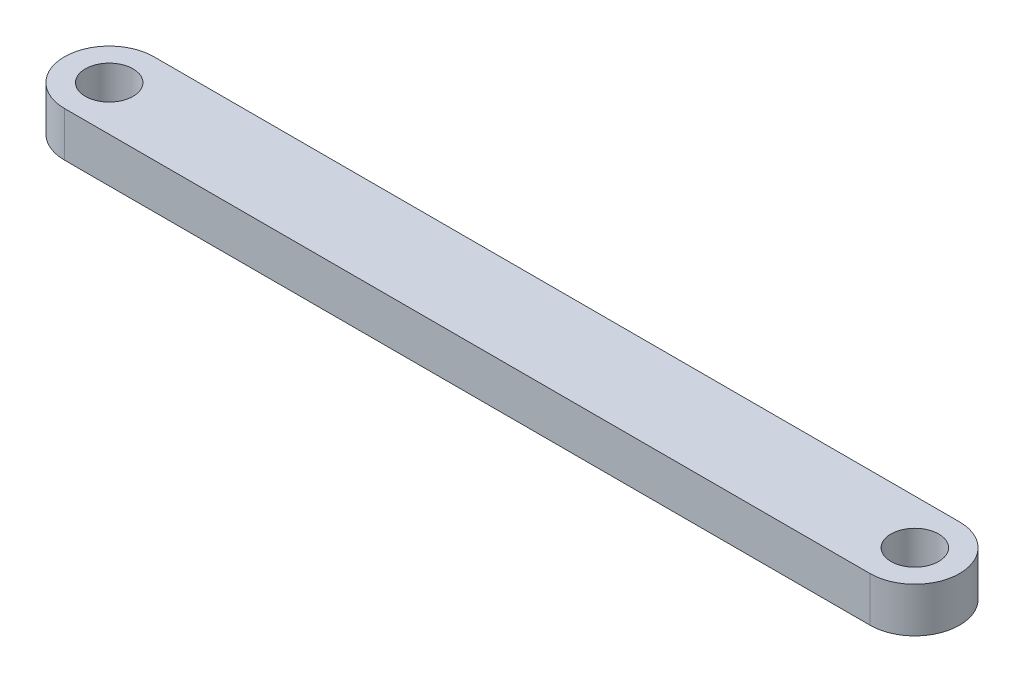
ISO-10303-21;
HEADER;
FILE_DESCRIPTION(('STEP AP214'),'2;1');
FILE_NAME('part.step','',(''),(''),'','','');
FILE_SCHEMA(('AUTOMOTIVE_DESIGN { 1 0 10303 214 1 1 1 1 }'));
ENDSEC;
DATA;
#1=APPLICATION_CONTEXT('core data for automotive mechanical design processes');
#2=APPLICATION_PROTOCOL_DEFINITION('international standard','automotive_design',2000,#1);
#3=PRODUCT_CONTEXT('',#1,'mechanical');
#4=PRODUCT('Part','Part','',(#3));
#5=PRODUCT_RELATED_PRODUCT_CATEGORY('part','',(#4));
#6=PRODUCT_DEFINITION_FORMATION('','',#4);
#7=PRODUCT_DEFINITION_CONTEXT('part definition',#1,'design');
#8=PRODUCT_DEFINITION('design','',#6,#7);
#9=PRODUCT_DEFINITION_SHAPE('','',#8);
#10=(LENGTH_UNIT() NAMED_UNIT(*) SI_UNIT(.MILLI.,.METRE.));
#11=(NAMED_UNIT(*) PLANE_ANGLE_UNIT() SI_UNIT($,.RADIAN.));
#12=(NAMED_UNIT(*) SI_UNIT($,.STERADIAN.) SOLID_ANGLE_UNIT());
#13=UNCERTAINTY_MEASURE_WITH_UNIT(LENGTH_MEASURE(1.E-05),#10,'distance_accuracy_value','');
#14=(GEOMETRIC_REPRESENTATION_CONTEXT(3) GLOBAL_UNCERTAINTY_ASSIGNED_CONTEXT((#13)) GLOBAL_UNIT_ASSIGNED_CONTEXT((#10,
#11,#12)) REPRESENTATION_CONTEXT('',''));
#15=CARTESIAN_POINT('',(0.,0.,0.));
#16=DIRECTION('',(0.,0.,1.));
#17=DIRECTION('',(1.,0.,0.));
#18=AXIS2_PLACEMENT_3D('',#15,#16,#17);
#19=CARTESIAN_POINT('',(-54.,3.,0.));
#20=DIRECTION('',(0.,-1.,0.));
#21=DIRECTION('',(0.,0.,-1.));
#22=AXIS2_PLACEMENT_3D('',#19,#20,#21);
#23=CYLINDRICAL_SURFACE('',#22,3.);
#24=CARTESIAN_POINT('',(-54.,0.,0.));
#25=DIRECTION('',(0.,1.,0.));
#26=DIRECTION('',(0.,0.,1.));
#27=AXIS2_PLACEMENT_3D('',#24,#25,#26);
#28=CIRCLE('',#27,3.);
#29=CARTESIAN_POINT('',(-54.,0.,-3.));
#30=VERTEX_POINT('',#29);
#31=CARTESIAN_POINT('',(-54.,0.,3.));
#32=VERTEX_POINT('',#31);
#33=EDGE_CURVE('E109',#30,#32,#28,.T.);
#34=ORIENTED_EDGE('',*,*,#33,.T.);
#35=DIRECTION('',(0.,-1.,0.));
#36=VECTOR('',#35,1.);
#37=CARTESIAN_POINT('',(-54.,3.,3.));
#38=LINE('',#37,#36);
#39=CARTESIAN_POINT('',(-54.,3.,3.));
#40=VERTEX_POINT('',#39);
#41=EDGE_CURVE('E11',#40,#32,#38,.T.);
#42=ORIENTED_EDGE('',*,*,#41,.F.);
#43=CARTESIAN_POINT('',(-54.,3.,0.));
#44=DIRECTION('',(0.,1.,0.));
#45=DIRECTION('',(0.,0.,1.));
#46=AXIS2_PLACEMENT_3D('',#43,#44,#45);
#47=CIRCLE('',#46,3.);
#48=CARTESIAN_POINT('',(-54.,3.,-3.));
#49=VERTEX_POINT('',#48);
#50=EDGE_CURVE('E93',#49,#40,#47,.T.);
#51=ORIENTED_EDGE('',*,*,#50,.F.);
#52=DIRECTION('',(0.,-1.,0.));
#53=VECTOR('',#52,1.);
#54=CARTESIAN_POINT('',(-54.,3.,-3.));
#55=LINE('',#54,#53);
#56=EDGE_CURVE('E105',#49,#30,#55,.T.);
#57=ORIENTED_EDGE('',*,*,#56,.T.);
#58=EDGE_LOOP('',(#34,#42,#51,#57));
#59=FACE_BOUND('',#58,.T.);
#60=ADVANCED_FACE('F41',(#59),#23,.T.);
#61=CARTESIAN_POINT('',(-54.,3.,3.));
#62=DIRECTION('',(0.,0.,-1.));
#63=DIRECTION('',(-1.,0.,0.));
#64=AXIS2_PLACEMENT_3D('',#61,#62,#63);
#65=PLANE('',#64);
#66=DIRECTION('',(1.,0.,0.));
#67=VECTOR('',#66,1.);
#68=CARTESIAN_POINT('',(-54.,0.,3.));
#69=LINE('',#68,#67);
#70=CARTESIAN_POINT('',(0.,0.,3.));
#71=VERTEX_POINT('',#70);
#72=EDGE_CURVE('E98',#32,#71,#69,.T.);
#73=ORIENTED_EDGE('',*,*,#72,.T.);
#74=DIRECTION('',(0.,-1.,0.));
#75=VECTOR('',#74,1.);
#76=CARTESIAN_POINT('',(0.,3.,3.));
#77=LINE('',#76,#75);
#78=CARTESIAN_POINT('',(0.,3.,3.));
#79=VERTEX_POINT('',#78);
#80=EDGE_CURVE('E50',#79,#71,#77,.T.);
#81=ORIENTED_EDGE('',*,*,#80,.F.);
#82=DIRECTION('',(1.,0.,0.));
#83=VECTOR('',#82,1.);
#84=CARTESIAN_POINT('',(-54.,3.,3.));
#85=LINE('',#84,#83);
#86=EDGE_CURVE('E88',#40,#79,#85,.T.);
#87=ORIENTED_EDGE('',*,*,#86,.F.);
#88=ORIENTED_EDGE('',*,*,#41,.T.);
#89=EDGE_LOOP('',(#73,#81,#87,#88));
#90=FACE_BOUND('',#89,.T.);
#91=ADVANCED_FACE('F97',(#90),#65,.F.);
#92=CARTESIAN_POINT('',(0.,3.,0.));
#93=DIRECTION('',(0.,-1.,0.));
#94=DIRECTION('',(0.,0.,-1.));
#95=AXIS2_PLACEMENT_3D('',#92,#93,#94);
#96=CYLINDRICAL_SURFACE('',#95,3.);
#97=CARTESIAN_POINT('',(0.,0.,0.));
#98=DIRECTION('',(0.,1.,0.));
#99=DIRECTION('',(0.,0.,1.));
#100=AXIS2_PLACEMENT_3D('',#97,#98,#99);
#101=CIRCLE('',#100,3.);
#102=CARTESIAN_POINT('',(0.,0.,-3.));
#103=VERTEX_POINT('',#102);
#104=EDGE_CURVE('E75',#71,#103,#101,.T.);
#105=ORIENTED_EDGE('',*,*,#104,.T.);
#106=DIRECTION('',(0.,-1.,0.));
#107=VECTOR('',#106,1.);
#108=CARTESIAN_POINT('',(0.,3.,-3.));
#109=LINE('',#108,#107);
#110=CARTESIAN_POINT('',(0.,3.,-3.));
#111=VERTEX_POINT('',#110);
#112=EDGE_CURVE('E100',#111,#103,#109,.T.);
#113=ORIENTED_EDGE('',*,*,#112,.F.);
#114=CARTESIAN_POINT('',(0.,3.,0.));
#115=DIRECTION('',(0.,1.,0.));
#116=DIRECTION('',(0.,0.,1.));
#117=AXIS2_PLACEMENT_3D('',#114,#115,#116);
#118=CIRCLE('',#117,3.);
#119=EDGE_CURVE('E91',#79,#111,#118,.T.);
#120=ORIENTED_EDGE('',*,*,#119,.F.);
#121=ORIENTED_EDGE('',*,*,#80,.T.);
#122=EDGE_LOOP('',(#105,#113,#120,#121));
#123=FACE_BOUND('',#122,.T.);
#124=ADVANCED_FACE('F101',(#123),#96,.T.);
#125=CARTESIAN_POINT('',(-54.,3.,-3.));
#126=DIRECTION('',(0.,0.,1.));
#127=DIRECTION('',(1.,0.,0.));
#128=AXIS2_PLACEMENT_3D('',#125,#126,#127);
#129=PLANE('',#128);
#130=DIRECTION('',(-1.,0.,0.));
#131=VECTOR('',#130,1.);
#132=CARTESIAN_POINT('',(-54.,0.,-3.));
#133=LINE('',#132,#131);
#134=EDGE_CURVE('E81',#103,#30,#133,.T.);
#135=ORIENTED_EDGE('',*,*,#134,.T.);
#136=ORIENTED_EDGE('',*,*,#56,.F.);
#137=DIRECTION('',(-1.,0.,0.));
#138=VECTOR('',#137,1.);
#139=CARTESIAN_POINT('',(-54.,3.,-3.));
#140=LINE('',#139,#138);
#141=EDGE_CURVE('E58',#111,#49,#140,.T.);
#142=ORIENTED_EDGE('',*,*,#141,.F.);
#143=ORIENTED_EDGE('',*,*,#112,.T.);
#144=EDGE_LOOP('',(#135,#136,#142,#143));
#145=FACE_BOUND('',#144,.T.);
#146=ADVANCED_FACE('F123',(#145),#129,.F.);
#147=CARTESIAN_POINT('',(-54.,3.,0.));
#148=DIRECTION('',(0.,1.,0.));
#149=DIRECTION('',(0.,0.,1.));
#150=AXIS2_PLACEMENT_3D('',#147,#148,#149);
#151=PLANE('',#150);
#152=CARTESIAN_POINT('',(-54.,3.,0.));
#153=DIRECTION('',(0.,1.,0.));
#154=DIRECTION('',(0.,0.,1.));
#155=AXIS2_PLACEMENT_3D('',#152,#153,#154);
#156=CIRCLE('',#155,1.6);
#157=CARTESIAN_POINT('',(-54.,3.,1.6));
#158=VERTEX_POINT('',#157);
#159=EDGE_CURVE('E138',#158,#158,#156,.T.);
#160=ORIENTED_EDGE('',*,*,#159,.F.);
#161=EDGE_LOOP('',(#160));
#162=FACE_BOUND('',#161,.T.);
#163=CARTESIAN_POINT('',(0.,3.,0.));
#164=DIRECTION('',(0.,1.,0.));
#165=DIRECTION('',(0.,0.,1.));
#166=AXIS2_PLACEMENT_3D('',#163,#164,#165);
#167=CIRCLE('',#166,1.6);
#168=CARTESIAN_POINT('',(0.,3.,1.6));
#169=VERTEX_POINT('',#168);
#170=EDGE_CURVE('E130',#169,#169,#167,.T.);
#171=ORIENTED_EDGE('',*,*,#170,.F.);
#172=EDGE_LOOP('',(#171));
#173=FACE_BOUND('',#172,.T.);
#174=ORIENTED_EDGE('',*,*,#50,.T.);
#175=ORIENTED_EDGE('',*,*,#86,.T.);
#176=ORIENTED_EDGE('',*,*,#119,.T.);
#177=ORIENTED_EDGE('',*,*,#141,.T.);
#178=EDGE_LOOP('',(#174,#175,#176,#177));
#179=FACE_BOUND('',#178,.T.);
#180=ADVANCED_FACE('F89',(#162,#173,#179),#151,.T.);
#181=CARTESIAN_POINT('',(-54.,0.,0.));
#182=DIRECTION('',(0.,1.,0.));
#183=DIRECTION('',(0.,0.,1.));
#184=AXIS2_PLACEMENT_3D('',#181,#182,#183);
#185=PLANE('',#184);
#186=CARTESIAN_POINT('',(-54.,0.,0.));
#187=DIRECTION('',(0.,1.,0.));
#188=DIRECTION('',(0.,0.,1.));
#189=AXIS2_PLACEMENT_3D('',#186,#187,#188);
#190=CIRCLE('',#189,1.6);
#191=CARTESIAN_POINT('',(-54.,0.,1.6));
#192=VERTEX_POINT('',#191);
#193=EDGE_CURVE('E113',#192,#192,#190,.T.);
#194=ORIENTED_EDGE('',*,*,#193,.T.);
#195=EDGE_LOOP('',(#194));
#196=FACE_BOUND('',#195,.T.);
#197=CARTESIAN_POINT('',(0.,0.,0.));
#198=DIRECTION('',(0.,1.,0.));
#199=DIRECTION('',(0.,0.,1.));
#200=AXIS2_PLACEMENT_3D('',#197,#198,#199);
#201=CIRCLE('',#200,1.6);
#202=CARTESIAN_POINT('',(0.,0.,1.6));
#203=VERTEX_POINT('',#202);
#204=EDGE_CURVE('E134',#203,#203,#201,.T.);
#205=ORIENTED_EDGE('',*,*,#204,.T.);
#206=EDGE_LOOP('',(#205));
#207=FACE_BOUND('',#206,.T.);
#208=ORIENTED_EDGE('',*,*,#33,.F.);
#209=ORIENTED_EDGE('',*,*,#134,.F.);
#210=ORIENTED_EDGE('',*,*,#104,.F.);
#211=ORIENTED_EDGE('',*,*,#72,.F.);
#212=EDGE_LOOP('',(#208,#209,#210,#211));
#213=FACE_BOUND('',#212,.T.);
#214=ADVANCED_FACE('F126',(#196,#207,#213),#185,.F.);
#215=CARTESIAN_POINT('',(0.,0.,0.));
#216=DIRECTION('',(0.,1.,0.));
#217=DIRECTION('',(0.,0.,1.));
#218=AXIS2_PLACEMENT_3D('',#215,#216,#217);
#219=CYLINDRICAL_SURFACE('',#218,1.6);
#220=ORIENTED_EDGE('',*,*,#204,.F.);
#221=EDGE_LOOP('',(#220));
#222=FACE_BOUND('',#221,.T.);
#223=ORIENTED_EDGE('',*,*,#170,.T.);
#224=EDGE_LOOP('',(#223));
#225=FACE_BOUND('',#224,.T.);
#226=ADVANCED_FACE('F151',(#222,#225),#219,.F.);
#227=CARTESIAN_POINT('',(-54.,0.,0.));
#228=DIRECTION('',(0.,1.,0.));
#229=DIRECTION('',(0.,0.,1.));
#230=AXIS2_PLACEMENT_3D('',#227,#228,#229);
#231=CYLINDRICAL_SURFACE('',#230,1.6);
#232=ORIENTED_EDGE('',*,*,#193,.F.);
#233=EDGE_LOOP('',(#232));
#234=FACE_BOUND('',#233,.T.);
#235=ORIENTED_EDGE('',*,*,#159,.T.);
#236=EDGE_LOOP('',(#235));
#237=FACE_BOUND('',#236,.T.);
#238=ADVANCED_FACE('F148',(#234,#237),#231,.F.);
#239=CLOSED_SHELL('',(#60,#91,#124,#146,#180,#214,#226,#238));
#240=MANIFOLD_SOLID_BREP('B2',#239);
#241=ADVANCED_BREP_SHAPE_REPRESENTATION('',(#18,#240),#14);
#242=SHAPE_DEFINITION_REPRESENTATION(#9,#241);
ENDSEC;
END-ISO-10303-21;
